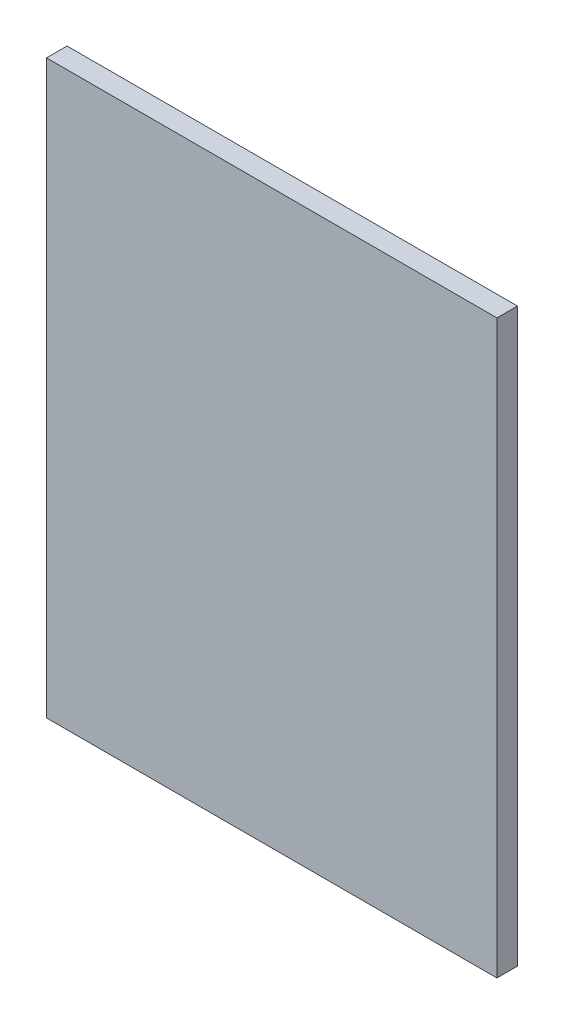
ISO-10303-21;
HEADER;
FILE_DESCRIPTION(('STEP AP214'),'2;1');
FILE_NAME('part.step','',(''),(''),'','','');
FILE_SCHEMA(('AUTOMOTIVE_DESIGN { 1 0 10303 214 1 1 1 1 }'));
ENDSEC;
DATA;
#1=APPLICATION_CONTEXT('core data for automotive mechanical design processes');
#2=APPLICATION_PROTOCOL_DEFINITION('international standard','automotive_design',2000,#1);
#3=PRODUCT_CONTEXT('',#1,'mechanical');
#4=PRODUCT('Part','Part','',(#3));
#5=PRODUCT_RELATED_PRODUCT_CATEGORY('part','',(#4));
#6=PRODUCT_DEFINITION_FORMATION('','',#4);
#7=PRODUCT_DEFINITION_CONTEXT('part definition',#1,'design');
#8=PRODUCT_DEFINITION('design','',#6,#7);
#9=PRODUCT_DEFINITION_SHAPE('','',#8);
#10=(LENGTH_UNIT() NAMED_UNIT(*) SI_UNIT(.MILLI.,.METRE.));
#11=(NAMED_UNIT(*) PLANE_ANGLE_UNIT() SI_UNIT($,.RADIAN.));
#12=(NAMED_UNIT(*) SI_UNIT($,.STERADIAN.) SOLID_ANGLE_UNIT());
#13=UNCERTAINTY_MEASURE_WITH_UNIT(LENGTH_MEASURE(1.E-05),#10,'distance_accuracy_value','');
#14=(GEOMETRIC_REPRESENTATION_CONTEXT(3) GLOBAL_UNCERTAINTY_ASSIGNED_CONTEXT((#13)) GLOBAL_UNIT_ASSIGNED_CONTEXT((#10,
#11,#12)) REPRESENTATION_CONTEXT('',''));
#15=CARTESIAN_POINT('',(0.,0.,0.));
#16=DIRECTION('',(0.,0.,1.));
#17=DIRECTION('',(1.,0.,0.));
#18=AXIS2_PLACEMENT_3D('',#15,#16,#17);
#19=CARTESIAN_POINT('',(95.7269973754883,88.181999206543,0.));
#20=DIRECTION('',(1.,0.,0.));
#21=DIRECTION('',(0.,-1.,0.));
#22=AXIS2_PLACEMENT_3D('',#19,#20,#21);
#23=PLANE('',#22);
#24=DIRECTION('',(0.,-1.,0.));
#25=VECTOR('',#24,1.);
#26=CARTESIAN_POINT('',(95.7269973754883,88.181999206543,0.03556));
#27=LINE('',#26,#25);
#28=CARTESIAN_POINT('',(95.7269973754883,88.181999206543,0.03556));
#29=VERTEX_POINT('',#28);
#30=CARTESIAN_POINT('',(95.7269973754883,87.1920013427734,0.03556));
#31=VERTEX_POINT('',#30);
#32=EDGE_CURVE('E11',#29,#31,#27,.T.);
#33=ORIENTED_EDGE('',*,*,#32,.F.);
#34=DIRECTION('',(0.,0.,1.));
#35=VECTOR('',#34,1.);
#36=CARTESIAN_POINT('',(95.7269973754883,88.181999206543,0.));
#37=LINE('',#36,#35);
#38=CARTESIAN_POINT('',(95.7269973754883,88.181999206543,0.));
#39=VERTEX_POINT('',#38);
#40=EDGE_CURVE('E24',#39,#29,#37,.T.);
#41=ORIENTED_EDGE('',*,*,#40,.F.);
#42=DIRECTION('',(0.,-1.,0.));
#43=VECTOR('',#42,1.);
#44=CARTESIAN_POINT('',(95.7269973754883,88.181999206543,0.));
#45=LINE('',#44,#43);
#46=CARTESIAN_POINT('',(95.7269973754883,87.1920013427734,0.));
#47=VERTEX_POINT('',#46);
#48=EDGE_CURVE('E75',#39,#47,#45,.T.);
#49=ORIENTED_EDGE('',*,*,#48,.T.);
#50=DIRECTION('',(0.,0.,1.));
#51=VECTOR('',#50,1.);
#52=CARTESIAN_POINT('',(95.7269973754883,87.1920013427734,0.));
#53=LINE('',#52,#51);
#54=EDGE_CURVE('E37',#47,#31,#53,.T.);
#55=ORIENTED_EDGE('',*,*,#54,.T.);
#56=EDGE_LOOP('',(#33,#41,#49,#55));
#57=FACE_BOUND('',#56,.T.);
#58=ADVANCED_FACE('F17',(#57),#23,.F.);
#59=CARTESIAN_POINT('',(95.7269973754883,87.1920013427734,0.));
#60=DIRECTION('',(0.,1.,0.));
#61=DIRECTION('',(1.,0.,0.));
#62=AXIS2_PLACEMENT_3D('',#59,#60,#61);
#63=PLANE('',#62);
#64=DIRECTION('',(1.,0.,0.));
#65=VECTOR('',#64,1.);
#66=CARTESIAN_POINT('',(95.7269973754883,87.1920013427734,0.03556));
#67=LINE('',#66,#65);
#68=CARTESIAN_POINT('',(96.5070037841797,87.1920013427734,0.03556));
#69=VERTEX_POINT('',#68);
#70=EDGE_CURVE('E83',#31,#69,#67,.T.);
#71=ORIENTED_EDGE('',*,*,#70,.F.);
#72=ORIENTED_EDGE('',*,*,#54,.F.);
#73=DIRECTION('',(1.,0.,0.));
#74=VECTOR('',#73,1.);
#75=CARTESIAN_POINT('',(95.7269973754883,87.1920013427734,0.));
#76=LINE('',#75,#74);
#77=CARTESIAN_POINT('',(96.5070037841797,87.1920013427734,0.));
#78=VERTEX_POINT('',#77);
#79=EDGE_CURVE('E81',#47,#78,#76,.T.);
#80=ORIENTED_EDGE('',*,*,#79,.T.);
#81=DIRECTION('',(0.,0.,1.));
#82=VECTOR('',#81,1.);
#83=CARTESIAN_POINT('',(96.5070037841797,87.1920013427734,0.));
#84=LINE('',#83,#82);
#85=EDGE_CURVE('E67',#78,#69,#84,.T.);
#86=ORIENTED_EDGE('',*,*,#85,.T.);
#87=EDGE_LOOP('',(#71,#72,#80,#86));
#88=FACE_BOUND('',#87,.T.);
#89=ADVANCED_FACE('F89',(#88),#63,.F.);
#90=CARTESIAN_POINT('',(96.5070037841797,87.1920013427734,0.));
#91=DIRECTION('',(-1.,0.,0.));
#92=DIRECTION('',(0.,1.,0.));
#93=AXIS2_PLACEMENT_3D('',#90,#91,#92);
#94=PLANE('',#93);
#95=DIRECTION('',(0.,1.,0.));
#96=VECTOR('',#95,1.);
#97=CARTESIAN_POINT('',(96.5070037841797,87.1920013427734,0.03556));
#98=LINE('',#97,#96);
#99=CARTESIAN_POINT('',(96.5070037841797,88.181999206543,0.03556));
#100=VERTEX_POINT('',#99);
#101=EDGE_CURVE('E71',#69,#100,#98,.T.);
#102=ORIENTED_EDGE('',*,*,#101,.F.);
#103=ORIENTED_EDGE('',*,*,#85,.F.);
#104=DIRECTION('',(0.,1.,0.));
#105=VECTOR('',#104,1.);
#106=CARTESIAN_POINT('',(96.5070037841797,87.1920013427734,0.));
#107=LINE('',#106,#105);
#108=CARTESIAN_POINT('',(96.5070037841797,88.181999206543,0.));
#109=VERTEX_POINT('',#108);
#110=EDGE_CURVE('E63',#78,#109,#107,.T.);
#111=ORIENTED_EDGE('',*,*,#110,.T.);
#112=DIRECTION('',(0.,0.,1.));
#113=VECTOR('',#112,1.);
#114=CARTESIAN_POINT('',(96.5070037841797,88.181999206543,0.));
#115=LINE('',#114,#113);
#116=EDGE_CURVE('E53',#109,#100,#115,.T.);
#117=ORIENTED_EDGE('',*,*,#116,.T.);
#118=EDGE_LOOP('',(#102,#103,#111,#117));
#119=FACE_BOUND('',#118,.T.);
#120=ADVANCED_FACE('F66',(#119),#94,.F.);
#121=CARTESIAN_POINT('',(96.5070037841797,88.181999206543,0.));
#122=DIRECTION('',(0.,-1.,0.));
#123=DIRECTION('',(-1.,0.,0.));
#124=AXIS2_PLACEMENT_3D('',#121,#122,#123);
#125=PLANE('',#124);
#126=DIRECTION('',(-1.,0.,0.));
#127=VECTOR('',#126,1.);
#128=CARTESIAN_POINT('',(96.5070037841797,88.181999206543,0.03556));
#129=LINE('',#128,#127);
#130=EDGE_CURVE('E59',#100,#29,#129,.T.);
#131=ORIENTED_EDGE('',*,*,#130,.F.);
#132=ORIENTED_EDGE('',*,*,#116,.F.);
#133=DIRECTION('',(-1.,0.,0.));
#134=VECTOR('',#133,1.);
#135=CARTESIAN_POINT('',(96.5070037841797,88.181999206543,0.));
#136=LINE('',#135,#134);
#137=EDGE_CURVE('E57',#109,#39,#136,.T.);
#138=ORIENTED_EDGE('',*,*,#137,.T.);
#139=ORIENTED_EDGE('',*,*,#40,.T.);
#140=EDGE_LOOP('',(#131,#132,#138,#139));
#141=FACE_BOUND('',#140,.T.);
#142=ADVANCED_FACE('F55',(#141),#125,.F.);
#143=CARTESIAN_POINT('',(95.7269973754883,88.181999206543,0.));
#144=DIRECTION('',(0.,0.,-1.));
#145=DIRECTION('',(-1.,0.,0.));
#146=AXIS2_PLACEMENT_3D('',#143,#144,#145);
#147=PLANE('',#146);
#148=ORIENTED_EDGE('',*,*,#137,.F.);
#149=ORIENTED_EDGE('',*,*,#110,.F.);
#150=ORIENTED_EDGE('',*,*,#79,.F.);
#151=ORIENTED_EDGE('',*,*,#48,.F.);
#152=EDGE_LOOP('',(#148,#149,#150,#151));
#153=FACE_BOUND('',#152,.T.);
#154=ADVANCED_FACE('F74',(#153),#147,.T.);
#155=CARTESIAN_POINT('',(95.7269973754883,88.181999206543,0.03556));
#156=DIRECTION('',(0.,0.,-1.));
#157=DIRECTION('',(-1.,0.,0.));
#158=AXIS2_PLACEMENT_3D('',#155,#156,#157);
#159=PLANE('',#158);
#160=ORIENTED_EDGE('',*,*,#32,.T.);
#161=ORIENTED_EDGE('',*,*,#70,.T.);
#162=ORIENTED_EDGE('',*,*,#101,.T.);
#163=ORIENTED_EDGE('',*,*,#130,.T.);
#164=EDGE_LOOP('',(#160,#161,#162,#163));
#165=FACE_BOUND('',#164,.T.);
#166=ADVANCED_FACE('F91',(#165),#159,.F.);
#167=CLOSED_SHELL('',(#58,#89,#120,#142,#154,#166));
#168=MANIFOLD_SOLID_BREP('B1',#167);
#169=ADVANCED_BREP_SHAPE_REPRESENTATION('',(#18,#168),#14);
#170=SHAPE_DEFINITION_REPRESENTATION(#9,#169);
ENDSEC;
END-ISO-10303-21;
